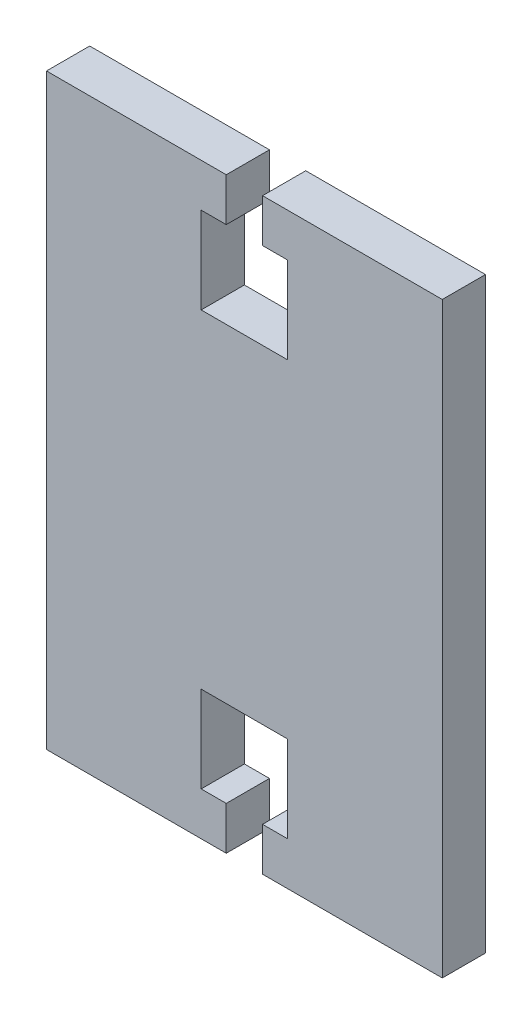
ISO-10303-21;
HEADER;
FILE_DESCRIPTION(('STEP AP214'),'2;1');
FILE_NAME('part.step','',(''),(''),'','','');
FILE_SCHEMA(('AUTOMOTIVE_DESIGN { 1 0 10303 214 1 1 1 1 }'));
ENDSEC;
DATA;
#1=APPLICATION_CONTEXT('core data for automotive mechanical design processes');
#2=APPLICATION_PROTOCOL_DEFINITION('international standard','automotive_design',2000,#1);
#3=PRODUCT_CONTEXT('',#1,'mechanical');
#4=PRODUCT('Part','Part','',(#3));
#5=PRODUCT_RELATED_PRODUCT_CATEGORY('part','',(#4));
#6=PRODUCT_DEFINITION_FORMATION('','',#4);
#7=PRODUCT_DEFINITION_CONTEXT('part definition',#1,'design');
#8=PRODUCT_DEFINITION('design','',#6,#7);
#9=PRODUCT_DEFINITION_SHAPE('','',#8);
#10=(LENGTH_UNIT() NAMED_UNIT(*) SI_UNIT(.MILLI.,.METRE.));
#11=(NAMED_UNIT(*) PLANE_ANGLE_UNIT() SI_UNIT($,.RADIAN.));
#12=(NAMED_UNIT(*) SI_UNIT($,.STERADIAN.) SOLID_ANGLE_UNIT());
#13=UNCERTAINTY_MEASURE_WITH_UNIT(LENGTH_MEASURE(1.E-05),#10,'distance_accuracy_value','');
#14=(GEOMETRIC_REPRESENTATION_CONTEXT(3) GLOBAL_UNCERTAINTY_ASSIGNED_CONTEXT((#13)) GLOBAL_UNIT_ASSIGNED_CONTEXT((#10,
#11,#12)) REPRESENTATION_CONTEXT('',''));
#15=CARTESIAN_POINT('',(0.,0.,0.));
#16=DIRECTION('',(0.,0.,1.));
#17=DIRECTION('',(1.,0.,0.));
#18=AXIS2_PLACEMENT_3D('',#15,#16,#17);
#19=CARTESIAN_POINT('',(22.9,-34.,5.));
#20=DIRECTION('',(0.,1.,0.));
#21=DIRECTION('',(0.,0.,1.));
#22=AXIS2_PLACEMENT_3D('',#19,#20,#21);
#23=PLANE('',#22);
#24=DIRECTION('',(1.,0.,0.));
#25=VECTOR('',#24,1.);
#26=CARTESIAN_POINT('',(22.9,-34.,0.));
#27=LINE('',#26,#25);
#28=CARTESIAN_POINT('',(-22.9,-34.,0.));
#29=VERTEX_POINT('',#28);
#30=CARTESIAN_POINT('',(-2.10000000000002,-34.,0.));
#31=VERTEX_POINT('',#30);
#32=EDGE_CURVE('E315',#29,#31,#27,.T.);
#33=ORIENTED_EDGE('',*,*,#32,.T.);
#34=DIRECTION('',(0.,0.,1.));
#35=VECTOR('',#34,1.);
#36=CARTESIAN_POINT('',(-2.10000000000002,-34.,0.));
#37=LINE('',#36,#35);
#38=CARTESIAN_POINT('',(-2.10000000000002,-34.,5.));
#39=VERTEX_POINT('',#38);
#40=EDGE_CURVE('E215',#31,#39,#37,.T.);
#41=ORIENTED_EDGE('',*,*,#40,.T.);
#42=DIRECTION('',(1.,0.,0.));
#43=VECTOR('',#42,1.);
#44=CARTESIAN_POINT('',(22.9,-34.,5.));
#45=LINE('',#44,#43);
#46=CARTESIAN_POINT('',(-22.9,-34.,5.));
#47=VERTEX_POINT('',#46);
#48=EDGE_CURVE('E302',#47,#39,#45,.T.);
#49=ORIENTED_EDGE('',*,*,#48,.F.);
#50=DIRECTION('',(0.,0.,-1.));
#51=VECTOR('',#50,1.);
#52=CARTESIAN_POINT('',(-22.9,-34.,5.));
#53=LINE('',#52,#51);
#54=EDGE_CURVE('E11',#47,#29,#53,.T.);
#55=ORIENTED_EDGE('',*,*,#54,.T.);
#56=EDGE_LOOP('',(#33,#41,#49,#55));
#57=FACE_BOUND('',#56,.T.);
#58=ADVANCED_FACE('F37',(#57),#23,.F.);
#59=CARTESIAN_POINT('',(22.9,34.,5.));
#60=DIRECTION('',(0.,-1.,0.));
#61=DIRECTION('',(1.,0.,0.));
#62=AXIS2_PLACEMENT_3D('',#59,#60,#61);
#63=PLANE('',#62);
#64=DIRECTION('',(-1.,0.,0.));
#65=VECTOR('',#64,1.);
#66=CARTESIAN_POINT('',(22.9,34.,5.));
#67=LINE('',#66,#65);
#68=CARTESIAN_POINT('',(-2.1,34.,5.));
#69=VERTEX_POINT('',#68);
#70=CARTESIAN_POINT('',(-22.9,34.,5.));
#71=VERTEX_POINT('',#70);
#72=EDGE_CURVE('E307',#69,#71,#67,.T.);
#73=ORIENTED_EDGE('',*,*,#72,.F.);
#74=DIRECTION('',(0.,0.,1.));
#75=VECTOR('',#74,1.);
#76=CARTESIAN_POINT('',(-2.1,34.,0.));
#77=LINE('',#76,#75);
#78=CARTESIAN_POINT('',(-2.1,34.,0.));
#79=VERTEX_POINT('',#78);
#80=EDGE_CURVE('E234',#79,#69,#77,.T.);
#81=ORIENTED_EDGE('',*,*,#80,.F.);
#82=DIRECTION('',(-1.,0.,0.));
#83=VECTOR('',#82,1.);
#84=CARTESIAN_POINT('',(22.9,34.,0.));
#85=LINE('',#84,#83);
#86=CARTESIAN_POINT('',(-22.9,34.,0.));
#87=VERTEX_POINT('',#86);
#88=EDGE_CURVE('E320',#79,#87,#85,.T.);
#89=ORIENTED_EDGE('',*,*,#88,.T.);
#90=DIRECTION('',(0.,0.,-1.));
#91=VECTOR('',#90,1.);
#92=CARTESIAN_POINT('',(-22.9,34.,5.));
#93=LINE('',#92,#91);
#94=EDGE_CURVE('E311',#71,#87,#93,.T.);
#95=ORIENTED_EDGE('',*,*,#94,.F.);
#96=EDGE_LOOP('',(#73,#81,#89,#95));
#97=FACE_BOUND('',#96,.T.);
#98=ADVANCED_FACE('F382',(#97),#63,.F.);
#99=CARTESIAN_POINT('',(-22.9,-34.,5.));
#100=DIRECTION('',(1.,0.,0.));
#101=DIRECTION('',(0.,0.,-1.));
#102=AXIS2_PLACEMENT_3D('',#99,#100,#101);
#103=PLANE('',#102);
#104=DIRECTION('',(0.,-1.,0.));
#105=VECTOR('',#104,1.);
#106=CARTESIAN_POINT('',(-22.9,-34.,0.));
#107=LINE('',#106,#105);
#108=EDGE_CURVE('E229',#87,#29,#107,.T.);
#109=ORIENTED_EDGE('',*,*,#108,.T.);
#110=ORIENTED_EDGE('',*,*,#54,.F.);
#111=DIRECTION('',(0.,-1.,0.));
#112=VECTOR('',#111,1.);
#113=CARTESIAN_POINT('',(-22.9,-34.,5.));
#114=LINE('',#113,#112);
#115=EDGE_CURVE('E297',#71,#47,#114,.T.);
#116=ORIENTED_EDGE('',*,*,#115,.F.);
#117=ORIENTED_EDGE('',*,*,#94,.T.);
#118=EDGE_LOOP('',(#109,#110,#116,#117));
#119=FACE_BOUND('',#118,.T.);
#120=ADVANCED_FACE('F39',(#119),#103,.F.);
#121=CARTESIAN_POINT('',(2.09999999999999,-34.,5.));
#122=VERTEX_POINT('',#121);
#123=CARTESIAN_POINT('',(22.9,-34.,5.));
#124=VERTEX_POINT('',#123);
#125=EDGE_CURVE('E300',#122,#124,#45,.T.);
#126=ORIENTED_EDGE('',*,*,#125,.F.);
#127=DIRECTION('',(0.,0.,1.));
#128=VECTOR('',#127,1.);
#129=CARTESIAN_POINT('',(2.09999999999999,-34.,0.));
#130=LINE('',#129,#128);
#131=CARTESIAN_POINT('',(2.09999999999999,-34.,0.));
#132=VERTEX_POINT('',#131);
#133=EDGE_CURVE('E262',#132,#122,#130,.T.);
#134=ORIENTED_EDGE('',*,*,#133,.F.);
#135=CARTESIAN_POINT('',(22.9,-34.,0.));
#136=VERTEX_POINT('',#135);
#137=EDGE_CURVE('E314',#132,#136,#27,.T.);
#138=ORIENTED_EDGE('',*,*,#137,.T.);
#139=DIRECTION('',(0.,0.,-1.));
#140=VECTOR('',#139,1.);
#141=CARTESIAN_POINT('',(22.9,-34.,5.));
#142=LINE('',#141,#140);
#143=EDGE_CURVE('E45',#124,#136,#142,.T.);
#144=ORIENTED_EDGE('',*,*,#143,.F.);
#145=EDGE_LOOP('',(#126,#134,#138,#144));
#146=FACE_BOUND('',#145,.T.);
#147=ADVANCED_FACE('F350',(#146),#23,.F.);
#148=CARTESIAN_POINT('',(22.9,-34.,5.));
#149=DIRECTION('',(-1.,0.,0.));
#150=DIRECTION('',(0.,0.,1.));
#151=AXIS2_PLACEMENT_3D('',#148,#149,#150);
#152=PLANE('',#151);
#153=DIRECTION('',(0.,1.,0.));
#154=VECTOR('',#153,1.);
#155=CARTESIAN_POINT('',(22.9,-34.,0.));
#156=LINE('',#155,#154);
#157=CARTESIAN_POINT('',(22.9,34.,0.));
#158=VERTEX_POINT('',#157);
#159=EDGE_CURVE('E318',#136,#158,#156,.T.);
#160=ORIENTED_EDGE('',*,*,#159,.T.);
#161=DIRECTION('',(0.,0.,-1.));
#162=VECTOR('',#161,1.);
#163=CARTESIAN_POINT('',(22.9,34.,5.));
#164=LINE('',#163,#162);
#165=CARTESIAN_POINT('',(22.9,34.,5.));
#166=VERTEX_POINT('',#165);
#167=EDGE_CURVE('E325',#166,#158,#164,.T.);
#168=ORIENTED_EDGE('',*,*,#167,.F.);
#169=DIRECTION('',(0.,1.,0.));
#170=VECTOR('',#169,1.);
#171=CARTESIAN_POINT('',(22.9,-34.,5.));
#172=LINE('',#171,#170);
#173=EDGE_CURVE('E305',#124,#166,#172,.T.);
#174=ORIENTED_EDGE('',*,*,#173,.F.);
#175=ORIENTED_EDGE('',*,*,#143,.T.);
#176=EDGE_LOOP('',(#160,#168,#174,#175));
#177=FACE_BOUND('',#176,.T.);
#178=ADVANCED_FACE('F332',(#177),#152,.F.);
#179=CARTESIAN_POINT('',(2.1,34.,0.));
#180=VERTEX_POINT('',#179);
#181=EDGE_CURVE('E301',#158,#180,#85,.T.);
#182=ORIENTED_EDGE('',*,*,#181,.T.);
#183=DIRECTION('',(0.,0.,1.));
#184=VECTOR('',#183,1.);
#185=CARTESIAN_POINT('',(2.1,34.,0.));
#186=LINE('',#185,#184);
#187=CARTESIAN_POINT('',(2.1,34.,5.));
#188=VERTEX_POINT('',#187);
#189=EDGE_CURVE('E236',#180,#188,#186,.T.);
#190=ORIENTED_EDGE('',*,*,#189,.T.);
#191=EDGE_CURVE('E308',#166,#188,#67,.T.);
#192=ORIENTED_EDGE('',*,*,#191,.F.);
#193=ORIENTED_EDGE('',*,*,#167,.T.);
#194=EDGE_LOOP('',(#182,#190,#192,#193));
#195=FACE_BOUND('',#194,.T.);
#196=ADVANCED_FACE('F340',(#195),#63,.F.);
#197=CARTESIAN_POINT('',(0.,0.,5.));
#198=DIRECTION('',(0.,0.,1.));
#199=DIRECTION('',(1.,0.,0.));
#200=AXIS2_PLACEMENT_3D('',#197,#198,#199);
#201=PLANE('',#200);
#202=DIRECTION('',(0.,-1.,0.));
#203=VECTOR('',#202,1.);
#204=CARTESIAN_POINT('',(-2.1,34.,5.));
#205=LINE('',#204,#203);
#206=CARTESIAN_POINT('',(-2.1,29.,5.));
#207=VERTEX_POINT('',#206);
#208=EDGE_CURVE('E222',#69,#207,#205,.T.);
#209=ORIENTED_EDGE('',*,*,#208,.F.);
#210=ORIENTED_EDGE('',*,*,#72,.T.);
#211=ORIENTED_EDGE('',*,*,#115,.T.);
#212=ORIENTED_EDGE('',*,*,#48,.T.);
#213=DIRECTION('',(0.,-1.,0.));
#214=VECTOR('',#213,1.);
#215=CARTESIAN_POINT('',(-2.10000000000002,-34.,5.));
#216=LINE('',#215,#214);
#217=CARTESIAN_POINT('',(-2.10000000000001,-29.,5.));
#218=VERTEX_POINT('',#217);
#219=EDGE_CURVE('E245',#218,#39,#216,.T.);
#220=ORIENTED_EDGE('',*,*,#219,.F.);
#221=DIRECTION('',(1.,0.,0.));
#222=VECTOR('',#221,1.);
#223=CARTESIAN_POINT('',(-2.10000000000001,-29.,5.));
#224=LINE('',#223,#222);
#225=CARTESIAN_POINT('',(-5.00000000000001,-29.,5.));
#226=VERTEX_POINT('',#225);
#227=EDGE_CURVE('E278',#226,#218,#224,.T.);
#228=ORIENTED_EDGE('',*,*,#227,.F.);
#229=DIRECTION('',(0.,-1.,0.));
#230=VECTOR('',#229,1.);
#231=CARTESIAN_POINT('',(-5.00000000000001,-29.,5.));
#232=LINE('',#231,#230);
#233=CARTESIAN_POINT('',(-5.00000000000001,-19.,5.));
#234=VERTEX_POINT('',#233);
#235=EDGE_CURVE('E275',#234,#226,#232,.T.);
#236=ORIENTED_EDGE('',*,*,#235,.F.);
#237=DIRECTION('',(-1.,0.,0.));
#238=VECTOR('',#237,1.);
#239=CARTESIAN_POINT('',(4.99999999999999,-19.,5.));
#240=LINE('',#239,#238);
#241=CARTESIAN_POINT('',(4.99999999999999,-19.,5.));
#242=VERTEX_POINT('',#241);
#243=EDGE_CURVE('E272',#242,#234,#240,.T.);
#244=ORIENTED_EDGE('',*,*,#243,.F.);
#245=DIRECTION('',(0.,1.,0.));
#246=VECTOR('',#245,1.);
#247=CARTESIAN_POINT('',(4.99999999999999,-29.,5.));
#248=LINE('',#247,#246);
#249=CARTESIAN_POINT('',(4.99999999999999,-29.,5.));
#250=VERTEX_POINT('',#249);
#251=EDGE_CURVE('E269',#250,#242,#248,.T.);
#252=ORIENTED_EDGE('',*,*,#251,.F.);
#253=DIRECTION('',(1.,0.,0.));
#254=VECTOR('',#253,1.);
#255=CARTESIAN_POINT('',(2.09999999999999,-29.,5.));
#256=LINE('',#255,#254);
#257=CARTESIAN_POINT('',(2.09999999999999,-29.,5.));
#258=VERTEX_POINT('',#257);
#259=EDGE_CURVE('E266',#258,#250,#256,.T.);
#260=ORIENTED_EDGE('',*,*,#259,.F.);
#261=DIRECTION('',(0.,1.,0.));
#262=VECTOR('',#261,1.);
#263=CARTESIAN_POINT('',(2.09999999999999,-34.,5.));
#264=LINE('',#263,#262);
#265=EDGE_CURVE('E263',#122,#258,#264,.T.);
#266=ORIENTED_EDGE('',*,*,#265,.F.);
#267=ORIENTED_EDGE('',*,*,#125,.T.);
#268=ORIENTED_EDGE('',*,*,#173,.T.);
#269=ORIENTED_EDGE('',*,*,#191,.T.);
#270=DIRECTION('',(0.,1.,0.));
#271=VECTOR('',#270,1.);
#272=CARTESIAN_POINT('',(2.1,34.,5.));
#273=LINE('',#272,#271);
#274=CARTESIAN_POINT('',(2.1,29.,5.));
#275=VERTEX_POINT('',#274);
#276=EDGE_CURVE('E220',#275,#188,#273,.T.);
#277=ORIENTED_EDGE('',*,*,#276,.F.);
#278=DIRECTION('',(-1.,0.,0.));
#279=VECTOR('',#278,1.);
#280=CARTESIAN_POINT('',(2.1,29.,5.));
#281=LINE('',#280,#279);
#282=CARTESIAN_POINT('',(5.,29.,5.));
#283=VERTEX_POINT('',#282);
#284=EDGE_CURVE('E217',#283,#275,#281,.T.);
#285=ORIENTED_EDGE('',*,*,#284,.F.);
#286=DIRECTION('',(0.,1.,0.));
#287=VECTOR('',#286,1.);
#288=CARTESIAN_POINT('',(5.,29.,5.));
#289=LINE('',#288,#287);
#290=CARTESIAN_POINT('',(5.,19.,5.));
#291=VERTEX_POINT('',#290);
#292=EDGE_CURVE('E214',#291,#283,#289,.T.);
#293=ORIENTED_EDGE('',*,*,#292,.F.);
#294=DIRECTION('',(1.,0.,0.));
#295=VECTOR('',#294,1.);
#296=CARTESIAN_POINT('',(5.,19.,5.));
#297=LINE('',#296,#295);
#298=CARTESIAN_POINT('',(-5.,19.,5.));
#299=VERTEX_POINT('',#298);
#300=EDGE_CURVE('E181',#299,#291,#297,.T.);
#301=ORIENTED_EDGE('',*,*,#300,.F.);
#302=DIRECTION('',(0.,-1.,0.));
#303=VECTOR('',#302,1.);
#304=CARTESIAN_POINT('',(-5.,29.,5.));
#305=LINE('',#304,#303);
#306=CARTESIAN_POINT('',(-5.,29.,5.));
#307=VERTEX_POINT('',#306);
#308=EDGE_CURVE('E197',#307,#299,#305,.T.);
#309=ORIENTED_EDGE('',*,*,#308,.F.);
#310=DIRECTION('',(-1.,0.,0.));
#311=VECTOR('',#310,1.);
#312=CARTESIAN_POINT('',(-2.1,29.,5.));
#313=LINE('',#312,#311);
#314=EDGE_CURVE('E200',#207,#307,#313,.T.);
#315=ORIENTED_EDGE('',*,*,#314,.F.);
#316=EDGE_LOOP('',(#209,#210,#211,#212,#220,#228,#236,#244,#252,#260,#266,#267,#268,#269,#277,
#285,#293,#301,#309,#315));
#317=FACE_BOUND('',#316,.T.);
#318=ADVANCED_FACE('F345',(#317),#201,.T.);
#319=CARTESIAN_POINT('',(0.,0.,0.));
#320=DIRECTION('',(0.,0.,1.));
#321=DIRECTION('',(1.,0.,0.));
#322=AXIS2_PLACEMENT_3D('',#319,#320,#321);
#323=PLANE('',#322);
#324=ORIENTED_EDGE('',*,*,#88,.F.);
#325=DIRECTION('',(0.,-1.,0.));
#326=VECTOR('',#325,1.);
#327=CARTESIAN_POINT('',(-2.1,34.,0.));
#328=LINE('',#327,#326);
#329=CARTESIAN_POINT('',(-2.1,29.,0.));
#330=VERTEX_POINT('',#329);
#331=EDGE_CURVE('E207',#79,#330,#328,.T.);
#332=ORIENTED_EDGE('',*,*,#331,.T.);
#333=DIRECTION('',(-1.,0.,0.));
#334=VECTOR('',#333,1.);
#335=CARTESIAN_POINT('',(-2.1,29.,0.));
#336=LINE('',#335,#334);
#337=CARTESIAN_POINT('',(-5.,29.,0.));
#338=VERTEX_POINT('',#337);
#339=EDGE_CURVE('E210',#330,#338,#336,.T.);
#340=ORIENTED_EDGE('',*,*,#339,.T.);
#341=DIRECTION('',(0.,-1.,0.));
#342=VECTOR('',#341,1.);
#343=CARTESIAN_POINT('',(-5.,29.,0.));
#344=LINE('',#343,#342);
#345=CARTESIAN_POINT('',(-5.,19.,0.));
#346=VERTEX_POINT('',#345);
#347=EDGE_CURVE('E186',#338,#346,#344,.T.);
#348=ORIENTED_EDGE('',*,*,#347,.T.);
#349=DIRECTION('',(1.,0.,0.));
#350=VECTOR('',#349,1.);
#351=CARTESIAN_POINT('',(5.,19.,0.));
#352=LINE('',#351,#350);
#353=CARTESIAN_POINT('',(5.,19.,0.));
#354=VERTEX_POINT('',#353);
#355=EDGE_CURVE('E178',#346,#354,#352,.T.);
#356=ORIENTED_EDGE('',*,*,#355,.T.);
#357=DIRECTION('',(0.,1.,0.));
#358=VECTOR('',#357,1.);
#359=CARTESIAN_POINT('',(5.,29.,0.));
#360=LINE('',#359,#358);
#361=CARTESIAN_POINT('',(5.,29.,0.));
#362=VERTEX_POINT('',#361);
#363=EDGE_CURVE('E189',#354,#362,#360,.T.);
#364=ORIENTED_EDGE('',*,*,#363,.T.);
#365=DIRECTION('',(-1.,0.,0.));
#366=VECTOR('',#365,1.);
#367=CARTESIAN_POINT('',(2.1,29.,0.));
#368=LINE('',#367,#366);
#369=CARTESIAN_POINT('',(2.1,29.,0.));
#370=VERTEX_POINT('',#369);
#371=EDGE_CURVE('E52',#362,#370,#368,.T.);
#372=ORIENTED_EDGE('',*,*,#371,.T.);
#373=DIRECTION('',(0.,1.,0.));
#374=VECTOR('',#373,1.);
#375=CARTESIAN_POINT('',(2.1,34.,0.));
#376=LINE('',#375,#374);
#377=EDGE_CURVE('E204',#370,#180,#376,.T.);
#378=ORIENTED_EDGE('',*,*,#377,.T.);
#379=ORIENTED_EDGE('',*,*,#181,.F.);
#380=ORIENTED_EDGE('',*,*,#159,.F.);
#381=ORIENTED_EDGE('',*,*,#137,.F.);
#382=DIRECTION('',(0.,1.,0.));
#383=VECTOR('',#382,1.);
#384=CARTESIAN_POINT('',(2.09999999999999,-34.,0.));
#385=LINE('',#384,#383);
#386=CARTESIAN_POINT('',(2.09999999999999,-29.,0.));
#387=VERTEX_POINT('',#386);
#388=EDGE_CURVE('E242',#132,#387,#385,.T.);
#389=ORIENTED_EDGE('',*,*,#388,.T.);
#390=DIRECTION('',(1.,0.,0.));
#391=VECTOR('',#390,1.);
#392=CARTESIAN_POINT('',(2.09999999999999,-29.,0.));
#393=LINE('',#392,#391);
#394=CARTESIAN_POINT('',(4.99999999999999,-29.,0.));
#395=VERTEX_POINT('',#394);
#396=EDGE_CURVE('E60',#387,#395,#393,.T.);
#397=ORIENTED_EDGE('',*,*,#396,.T.);
#398=DIRECTION('',(0.,1.,0.));
#399=VECTOR('',#398,1.);
#400=CARTESIAN_POINT('',(4.99999999999999,-29.,0.));
#401=LINE('',#400,#399);
#402=CARTESIAN_POINT('',(4.99999999999999,-19.,0.));
#403=VERTEX_POINT('',#402);
#404=EDGE_CURVE('E247',#395,#403,#401,.T.);
#405=ORIENTED_EDGE('',*,*,#404,.T.);
#406=DIRECTION('',(-1.,0.,0.));
#407=VECTOR('',#406,1.);
#408=CARTESIAN_POINT('',(4.99999999999999,-19.,0.));
#409=LINE('',#408,#407);
#410=CARTESIAN_POINT('',(-5.00000000000001,-19.,0.));
#411=VERTEX_POINT('',#410);
#412=EDGE_CURVE('E250',#403,#411,#409,.T.);
#413=ORIENTED_EDGE('',*,*,#412,.T.);
#414=DIRECTION('',(0.,-1.,0.));
#415=VECTOR('',#414,1.);
#416=CARTESIAN_POINT('',(-5.00000000000001,-29.,0.));
#417=LINE('',#416,#415);
#418=CARTESIAN_POINT('',(-5.00000000000001,-29.,0.));
#419=VERTEX_POINT('',#418);
#420=EDGE_CURVE('E253',#411,#419,#417,.T.);
#421=ORIENTED_EDGE('',*,*,#420,.T.);
#422=DIRECTION('',(1.,0.,0.));
#423=VECTOR('',#422,1.);
#424=CARTESIAN_POINT('',(-2.10000000000001,-29.,0.));
#425=LINE('',#424,#423);
#426=CARTESIAN_POINT('',(-2.10000000000001,-29.,0.));
#427=VERTEX_POINT('',#426);
#428=EDGE_CURVE('E256',#419,#427,#425,.T.);
#429=ORIENTED_EDGE('',*,*,#428,.T.);
#430=DIRECTION('',(0.,-1.,0.));
#431=VECTOR('',#430,1.);
#432=CARTESIAN_POINT('',(-2.10000000000002,-34.,0.));
#433=LINE('',#432,#431);
#434=EDGE_CURVE('E259',#427,#31,#433,.T.);
#435=ORIENTED_EDGE('',*,*,#434,.T.);
#436=ORIENTED_EDGE('',*,*,#32,.F.);
#437=ORIENTED_EDGE('',*,*,#108,.F.);
#438=EDGE_LOOP('',(#324,#332,#340,#348,#356,#364,#372,#378,#379,#380,#381,#389,#397,#405,#413,
#421,#429,#435,#436,#437));
#439=FACE_BOUND('',#438,.T.);
#440=ADVANCED_FACE('F194',(#439),#323,.F.);
#441=CARTESIAN_POINT('',(-2.10000000000002,-34.,0.));
#442=DIRECTION('',(-1.,0.,0.));
#443=DIRECTION('',(0.,-1.,0.));
#444=AXIS2_PLACEMENT_3D('',#441,#442,#443);
#445=PLANE('',#444);
#446=ORIENTED_EDGE('',*,*,#219,.T.);
#447=ORIENTED_EDGE('',*,*,#40,.F.);
#448=ORIENTED_EDGE('',*,*,#434,.F.);
#449=DIRECTION('',(0.,0.,1.));
#450=VECTOR('',#449,1.);
#451=CARTESIAN_POINT('',(-2.10000000000001,-29.,0.));
#452=LINE('',#451,#450);
#453=EDGE_CURVE('E284',#427,#218,#452,.T.);
#454=ORIENTED_EDGE('',*,*,#453,.T.);
#455=EDGE_LOOP('',(#446,#447,#448,#454));
#456=FACE_BOUND('',#455,.T.);
#457=ADVANCED_FACE('F372',(#456),#445,.F.);
#458=CARTESIAN_POINT('',(-2.10000000000001,-29.,0.));
#459=DIRECTION('',(0.,-1.,0.));
#460=DIRECTION('',(0.,0.,-1.));
#461=AXIS2_PLACEMENT_3D('',#458,#459,#460);
#462=PLANE('',#461);
#463=ORIENTED_EDGE('',*,*,#227,.T.);
#464=ORIENTED_EDGE('',*,*,#453,.F.);
#465=ORIENTED_EDGE('',*,*,#428,.F.);
#466=DIRECTION('',(0.,0.,1.));
#467=VECTOR('',#466,1.);
#468=CARTESIAN_POINT('',(-5.00000000000001,-29.,0.));
#469=LINE('',#468,#467);
#470=EDGE_CURVE('E286',#419,#226,#469,.T.);
#471=ORIENTED_EDGE('',*,*,#470,.T.);
#472=EDGE_LOOP('',(#463,#464,#465,#471));
#473=FACE_BOUND('',#472,.T.);
#474=ADVANCED_FACE('F368',(#473),#462,.F.);
#475=CARTESIAN_POINT('',(-5.00000000000001,-29.,0.));
#476=DIRECTION('',(-1.,0.,0.));
#477=DIRECTION('',(0.,-1.,0.));
#478=AXIS2_PLACEMENT_3D('',#475,#476,#477);
#479=PLANE('',#478);
#480=ORIENTED_EDGE('',*,*,#235,.T.);
#481=ORIENTED_EDGE('',*,*,#470,.F.);
#482=ORIENTED_EDGE('',*,*,#420,.F.);
#483=DIRECTION('',(0.,0.,1.));
#484=VECTOR('',#483,1.);
#485=CARTESIAN_POINT('',(-5.00000000000001,-19.,0.));
#486=LINE('',#485,#484);
#487=EDGE_CURVE('E288',#411,#234,#486,.T.);
#488=ORIENTED_EDGE('',*,*,#487,.T.);
#489=EDGE_LOOP('',(#480,#481,#482,#488));
#490=FACE_BOUND('',#489,.T.);
#491=ADVANCED_FACE('F364',(#490),#479,.F.);
#492=CARTESIAN_POINT('',(4.99999999999999,-19.,0.));
#493=DIRECTION('',(0.,1.,0.));
#494=DIRECTION('',(-1.,0.,0.));
#495=AXIS2_PLACEMENT_3D('',#492,#493,#494);
#496=PLANE('',#495);
#497=ORIENTED_EDGE('',*,*,#243,.T.);
#498=ORIENTED_EDGE('',*,*,#487,.F.);
#499=ORIENTED_EDGE('',*,*,#412,.F.);
#500=DIRECTION('',(0.,0.,1.));
#501=VECTOR('',#500,1.);
#502=CARTESIAN_POINT('',(4.99999999999999,-19.,0.));
#503=LINE('',#502,#501);
#504=EDGE_CURVE('E290',#403,#242,#503,.T.);
#505=ORIENTED_EDGE('',*,*,#504,.T.);
#506=EDGE_LOOP('',(#497,#498,#499,#505));
#507=FACE_BOUND('',#506,.T.);
#508=ADVANCED_FACE('F360',(#507),#496,.F.);
#509=CARTESIAN_POINT('',(4.99999999999999,-29.,0.));
#510=DIRECTION('',(1.,0.,0.));
#511=DIRECTION('',(0.,1.,0.));
#512=AXIS2_PLACEMENT_3D('',#509,#510,#511);
#513=PLANE('',#512);
#514=ORIENTED_EDGE('',*,*,#251,.T.);
#515=ORIENTED_EDGE('',*,*,#504,.F.);
#516=ORIENTED_EDGE('',*,*,#404,.F.);
#517=DIRECTION('',(0.,0.,1.));
#518=VECTOR('',#517,1.);
#519=CARTESIAN_POINT('',(4.99999999999999,-29.,0.));
#520=LINE('',#519,#518);
#521=EDGE_CURVE('E292',#395,#250,#520,.T.);
#522=ORIENTED_EDGE('',*,*,#521,.T.);
#523=EDGE_LOOP('',(#514,#515,#516,#522));
#524=FACE_BOUND('',#523,.T.);
#525=ADVANCED_FACE('F356',(#524),#513,.F.);
#526=CARTESIAN_POINT('',(2.09999999999999,-29.,0.));
#527=DIRECTION('',(0.,-1.,0.));
#528=DIRECTION('',(0.,0.,-1.));
#529=AXIS2_PLACEMENT_3D('',#526,#527,#528);
#530=PLANE('',#529);
#531=ORIENTED_EDGE('',*,*,#259,.T.);
#532=ORIENTED_EDGE('',*,*,#521,.F.);
#533=ORIENTED_EDGE('',*,*,#396,.F.);
#534=DIRECTION('',(0.,0.,1.));
#535=VECTOR('',#534,1.);
#536=CARTESIAN_POINT('',(2.09999999999999,-29.,0.));
#537=LINE('',#536,#535);
#538=EDGE_CURVE('E294',#387,#258,#537,.T.);
#539=ORIENTED_EDGE('',*,*,#538,.T.);
#540=EDGE_LOOP('',(#531,#532,#533,#539));
#541=FACE_BOUND('',#540,.T.);
#542=ADVANCED_FACE('F486',(#541),#530,.F.);
#543=CARTESIAN_POINT('',(2.09999999999999,-34.,0.));
#544=DIRECTION('',(1.,0.,0.));
#545=DIRECTION('',(0.,1.,0.));
#546=AXIS2_PLACEMENT_3D('',#543,#544,#545);
#547=PLANE('',#546);
#548=ORIENTED_EDGE('',*,*,#265,.T.);
#549=ORIENTED_EDGE('',*,*,#538,.F.);
#550=ORIENTED_EDGE('',*,*,#388,.F.);
#551=ORIENTED_EDGE('',*,*,#133,.T.);
#552=EDGE_LOOP('',(#548,#549,#550,#551));
#553=FACE_BOUND('',#552,.T.);
#554=ADVANCED_FACE('F352',(#553),#547,.F.);
#555=CARTESIAN_POINT('',(5.,19.,0.));
#556=DIRECTION('',(0.,-1.,0.));
#557=DIRECTION('',(0.,0.,-1.));
#558=AXIS2_PLACEMENT_3D('',#555,#556,#557);
#559=PLANE('',#558);
#560=ORIENTED_EDGE('',*,*,#300,.T.);
#561=DIRECTION('',(0.,0.,1.));
#562=VECTOR('',#561,1.);
#563=CARTESIAN_POINT('',(5.,19.,0.));
#564=LINE('',#563,#562);
#565=EDGE_CURVE('E174',#354,#291,#564,.T.);
#566=ORIENTED_EDGE('',*,*,#565,.F.);
#567=ORIENTED_EDGE('',*,*,#355,.F.);
#568=DIRECTION('',(0.,0.,1.));
#569=VECTOR('',#568,1.);
#570=CARTESIAN_POINT('',(-5.,19.,0.));
#571=LINE('',#570,#569);
#572=EDGE_CURVE('E227',#346,#299,#571,.T.);
#573=ORIENTED_EDGE('',*,*,#572,.T.);
#574=EDGE_LOOP('',(#560,#566,#567,#573));
#575=FACE_BOUND('',#574,.T.);
#576=ADVANCED_FACE('F176',(#575),#559,.F.);
#577=CARTESIAN_POINT('',(-5.,29.,0.));
#578=DIRECTION('',(-1.,0.,0.));
#579=DIRECTION('',(0.,-1.,0.));
#580=AXIS2_PLACEMENT_3D('',#577,#578,#579);
#581=PLANE('',#580);
#582=ORIENTED_EDGE('',*,*,#308,.T.);
#583=ORIENTED_EDGE('',*,*,#572,.F.);
#584=ORIENTED_EDGE('',*,*,#347,.F.);
#585=DIRECTION('',(0.,0.,1.));
#586=VECTOR('',#585,1.);
#587=CARTESIAN_POINT('',(-5.,29.,0.));
#588=LINE('',#587,#586);
#589=EDGE_CURVE('E230',#338,#307,#588,.T.);
#590=ORIENTED_EDGE('',*,*,#589,.T.);
#591=EDGE_LOOP('',(#582,#583,#584,#590));
#592=FACE_BOUND('',#591,.T.);
#593=ADVANCED_FACE('F391',(#592),#581,.F.);
#594=CARTESIAN_POINT('',(-2.1,29.,0.));
#595=DIRECTION('',(0.,1.,0.));
#596=DIRECTION('',(0.,0.,1.));
#597=AXIS2_PLACEMENT_3D('',#594,#595,#596);
#598=PLANE('',#597);
#599=ORIENTED_EDGE('',*,*,#314,.T.);
#600=ORIENTED_EDGE('',*,*,#589,.F.);
#601=ORIENTED_EDGE('',*,*,#339,.F.);
#602=DIRECTION('',(0.,0.,1.));
#603=VECTOR('',#602,1.);
#604=CARTESIAN_POINT('',(-2.1,29.,0.));
#605=LINE('',#604,#603);
#606=EDGE_CURVE('E232',#330,#207,#605,.T.);
#607=ORIENTED_EDGE('',*,*,#606,.T.);
#608=EDGE_LOOP('',(#599,#600,#601,#607));
#609=FACE_BOUND('',#608,.T.);
#610=ADVANCED_FACE('F388',(#609),#598,.F.);
#611=CARTESIAN_POINT('',(-2.1,34.,0.));
#612=DIRECTION('',(-1.,0.,0.));
#613=DIRECTION('',(0.,-1.,0.));
#614=AXIS2_PLACEMENT_3D('',#611,#612,#613);
#615=PLANE('',#614);
#616=ORIENTED_EDGE('',*,*,#208,.T.);
#617=ORIENTED_EDGE('',*,*,#606,.F.);
#618=ORIENTED_EDGE('',*,*,#331,.F.);
#619=ORIENTED_EDGE('',*,*,#80,.T.);
#620=EDGE_LOOP('',(#616,#617,#618,#619));
#621=FACE_BOUND('',#620,.T.);
#622=ADVANCED_FACE('F384',(#621),#615,.F.);
#623=CARTESIAN_POINT('',(2.1,34.,0.));
#624=DIRECTION('',(1.,0.,0.));
#625=DIRECTION('',(0.,1.,0.));
#626=AXIS2_PLACEMENT_3D('',#623,#624,#625);
#627=PLANE('',#626);
#628=ORIENTED_EDGE('',*,*,#276,.T.);
#629=ORIENTED_EDGE('',*,*,#189,.F.);
#630=ORIENTED_EDGE('',*,*,#377,.F.);
#631=DIRECTION('',(0.,0.,1.));
#632=VECTOR('',#631,1.);
#633=CARTESIAN_POINT('',(2.1,29.,0.));
#634=LINE('',#633,#632);
#635=EDGE_CURVE('E239',#370,#275,#634,.T.);
#636=ORIENTED_EDGE('',*,*,#635,.T.);
#637=EDGE_LOOP('',(#628,#629,#630,#636));
#638=FACE_BOUND('',#637,.T.);
#639=ADVANCED_FACE('F394',(#638),#627,.F.);
#640=CARTESIAN_POINT('',(2.1,29.,0.));
#641=DIRECTION('',(0.,1.,0.));
#642=DIRECTION('',(0.,0.,1.));
#643=AXIS2_PLACEMENT_3D('',#640,#641,#642);
#644=PLANE('',#643);
#645=ORIENTED_EDGE('',*,*,#284,.T.);
#646=ORIENTED_EDGE('',*,*,#635,.F.);
#647=ORIENTED_EDGE('',*,*,#371,.F.);
#648=DIRECTION('',(0.,0.,1.));
#649=VECTOR('',#648,1.);
#650=CARTESIAN_POINT('',(5.,29.,0.));
#651=LINE('',#650,#649);
#652=EDGE_CURVE('E185',#362,#283,#651,.T.);
#653=ORIENTED_EDGE('',*,*,#652,.T.);
#654=EDGE_LOOP('',(#645,#646,#647,#653));
#655=FACE_BOUND('',#654,.T.);
#656=ADVANCED_FACE('F392',(#655),#644,.F.);
#657=CARTESIAN_POINT('',(5.,29.,0.));
#658=DIRECTION('',(1.,0.,0.));
#659=DIRECTION('',(0.,1.,0.));
#660=AXIS2_PLACEMENT_3D('',#657,#658,#659);
#661=PLANE('',#660);
#662=ORIENTED_EDGE('',*,*,#292,.T.);
#663=ORIENTED_EDGE('',*,*,#652,.F.);
#664=ORIENTED_EDGE('',*,*,#363,.F.);
#665=ORIENTED_EDGE('',*,*,#565,.T.);
#666=EDGE_LOOP('',(#662,#663,#664,#665));
#667=FACE_BOUND('',#666,.T.);
#668=ADVANCED_FACE('F190',(#667),#661,.F.);
#669=CLOSED_SHELL('',(#58,#98,#120,#147,#178,#196,#318,#440,#457,#474,#491,#508,#525,#542,#554,
#576,#593,#610,#622,#639,#656,#668));
#670=MANIFOLD_SOLID_BREP('B2',#669);
#671=ADVANCED_BREP_SHAPE_REPRESENTATION('',(#18,#670),#14);
#672=SHAPE_DEFINITION_REPRESENTATION(#9,#671);
ENDSEC;
END-ISO-10303-21;
